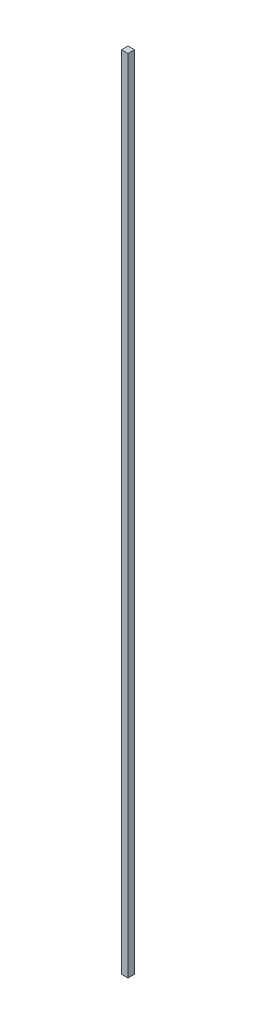
ISO-10303-21;
HEADER;
FILE_DESCRIPTION(('STEP AP214'),'2;1');
FILE_NAME('part.step','',(''),(''),'','','');
FILE_SCHEMA(('AUTOMOTIVE_DESIGN { 1 0 10303 214 1 1 1 1 }'));
ENDSEC;
DATA;
#1=APPLICATION_CONTEXT('core data for automotive mechanical design processes');
#2=APPLICATION_PROTOCOL_DEFINITION('international standard','automotive_design',2000,#1);
#3=PRODUCT_CONTEXT('',#1,'mechanical');
#4=PRODUCT('Part','Part','',(#3));
#5=PRODUCT_RELATED_PRODUCT_CATEGORY('part','',(#4));
#6=PRODUCT_DEFINITION_FORMATION('','',#4);
#7=PRODUCT_DEFINITION_CONTEXT('part definition',#1,'design');
#8=PRODUCT_DEFINITION('design','',#6,#7);
#9=PRODUCT_DEFINITION_SHAPE('','',#8);
#10=(LENGTH_UNIT() NAMED_UNIT(*) SI_UNIT(.MILLI.,.METRE.));
#11=(NAMED_UNIT(*) PLANE_ANGLE_UNIT() SI_UNIT($,.RADIAN.));
#12=(NAMED_UNIT(*) SI_UNIT($,.STERADIAN.) SOLID_ANGLE_UNIT());
#13=UNCERTAINTY_MEASURE_WITH_UNIT(LENGTH_MEASURE(1.E-05),#10,'distance_accuracy_value','');
#14=(GEOMETRIC_REPRESENTATION_CONTEXT(3) GLOBAL_UNCERTAINTY_ASSIGNED_CONTEXT((#13)) GLOBAL_UNIT_ASSIGNED_CONTEXT((#10,
#11,#12)) REPRESENTATION_CONTEXT('',''));
#15=CARTESIAN_POINT('',(0.,0.,0.));
#16=DIRECTION('',(0.,0.,1.));
#17=DIRECTION('',(1.,0.,0.));
#18=AXIS2_PLACEMENT_3D('',#15,#16,#17);
#19=CARTESIAN_POINT('',(0.,2465.,0.));
#20=DIRECTION('',(1.,0.,0.));
#21=DIRECTION('',(0.,0.,-1.));
#22=AXIS2_PLACEMENT_3D('',#19,#20,#21);
#23=PLANE('',#22);
#24=DIRECTION('',(0.,0.,1.));
#25=VECTOR('',#24,1.);
#26=CARTESIAN_POINT('',(0.,0.,0.));
#27=LINE('',#26,#25);
#28=CARTESIAN_POINT('',(0.,0.,0.));
#29=VERTEX_POINT('',#28);
#30=CARTESIAN_POINT('',(0.,0.,20.));
#31=VERTEX_POINT('',#30);
#32=EDGE_CURVE('E95',#29,#31,#27,.T.);
#33=ORIENTED_EDGE('',*,*,#32,.T.);
#34=DIRECTION('',(0.,-1.,0.));
#35=VECTOR('',#34,1.);
#36=CARTESIAN_POINT('',(0.,2465.,20.));
#37=LINE('',#36,#35);
#38=CARTESIAN_POINT('',(0.,2465.,20.));
#39=VERTEX_POINT('',#38);
#40=EDGE_CURVE('E11',#39,#31,#37,.T.);
#41=ORIENTED_EDGE('',*,*,#40,.F.);
#42=DIRECTION('',(0.,0.,1.));
#43=VECTOR('',#42,1.);
#44=CARTESIAN_POINT('',(0.,2465.,0.));
#45=LINE('',#44,#43);
#46=CARTESIAN_POINT('',(0.,2465.,0.));
#47=VERTEX_POINT('',#46);
#48=EDGE_CURVE('E83',#47,#39,#45,.T.);
#49=ORIENTED_EDGE('',*,*,#48,.F.);
#50=DIRECTION('',(0.,-1.,0.));
#51=VECTOR('',#50,1.);
#52=CARTESIAN_POINT('',(0.,2465.,0.));
#53=LINE('',#52,#51);
#54=EDGE_CURVE('E91',#47,#29,#53,.T.);
#55=ORIENTED_EDGE('',*,*,#54,.T.);
#56=EDGE_LOOP('',(#33,#41,#49,#55));
#57=FACE_BOUND('',#56,.T.);
#58=ADVANCED_FACE('F32',(#57),#23,.F.);
#59=CARTESIAN_POINT('',(0.,2465.,20.));
#60=DIRECTION('',(0.,0.,-1.));
#61=DIRECTION('',(-1.,0.,0.));
#62=AXIS2_PLACEMENT_3D('',#59,#60,#61);
#63=PLANE('',#62);
#64=DIRECTION('',(1.,0.,0.));
#65=VECTOR('',#64,1.);
#66=CARTESIAN_POINT('',(0.,0.,20.));
#67=LINE('',#66,#65);
#68=CARTESIAN_POINT('',(20.,0.,20.));
#69=VERTEX_POINT('',#68);
#70=EDGE_CURVE('E87',#31,#69,#67,.T.);
#71=ORIENTED_EDGE('',*,*,#70,.T.);
#72=DIRECTION('',(0.,-1.,0.));
#73=VECTOR('',#72,1.);
#74=CARTESIAN_POINT('',(20.,2465.,20.));
#75=LINE('',#74,#73);
#76=CARTESIAN_POINT('',(20.,2465.,20.));
#77=VERTEX_POINT('',#76);
#78=EDGE_CURVE('E40',#77,#69,#75,.T.);
#79=ORIENTED_EDGE('',*,*,#78,.F.);
#80=DIRECTION('',(1.,0.,0.));
#81=VECTOR('',#80,1.);
#82=CARTESIAN_POINT('',(0.,2465.,20.));
#83=LINE('',#82,#81);
#84=EDGE_CURVE('E78',#39,#77,#83,.T.);
#85=ORIENTED_EDGE('',*,*,#84,.F.);
#86=ORIENTED_EDGE('',*,*,#40,.T.);
#87=EDGE_LOOP('',(#71,#79,#85,#86));
#88=FACE_BOUND('',#87,.T.);
#89=ADVANCED_FACE('F86',(#88),#63,.F.);
#90=CARTESIAN_POINT('',(20.,2465.,0.));
#91=DIRECTION('',(-1.,0.,0.));
#92=DIRECTION('',(0.,0.,1.));
#93=AXIS2_PLACEMENT_3D('',#90,#91,#92);
#94=PLANE('',#93);
#95=DIRECTION('',(0.,0.,-1.));
#96=VECTOR('',#95,1.);
#97=CARTESIAN_POINT('',(20.,0.,0.));
#98=LINE('',#97,#96);
#99=CARTESIAN_POINT('',(20.,0.,0.));
#100=VERTEX_POINT('',#99);
#101=EDGE_CURVE('E65',#69,#100,#98,.T.);
#102=ORIENTED_EDGE('',*,*,#101,.T.);
#103=DIRECTION('',(0.,-1.,0.));
#104=VECTOR('',#103,1.);
#105=CARTESIAN_POINT('',(20.,2465.,0.));
#106=LINE('',#105,#104);
#107=CARTESIAN_POINT('',(20.,2465.,0.));
#108=VERTEX_POINT('',#107);
#109=EDGE_CURVE('E88',#108,#100,#106,.T.);
#110=ORIENTED_EDGE('',*,*,#109,.F.);
#111=DIRECTION('',(0.,0.,-1.));
#112=VECTOR('',#111,1.);
#113=CARTESIAN_POINT('',(20.,2465.,0.));
#114=LINE('',#113,#112);
#115=EDGE_CURVE('E81',#77,#108,#114,.T.);
#116=ORIENTED_EDGE('',*,*,#115,.F.);
#117=ORIENTED_EDGE('',*,*,#78,.T.);
#118=EDGE_LOOP('',(#102,#110,#116,#117));
#119=FACE_BOUND('',#118,.T.);
#120=ADVANCED_FACE('F89',(#119),#94,.F.);
#121=CARTESIAN_POINT('',(0.,2465.,0.));
#122=DIRECTION('',(0.,0.,1.));
#123=DIRECTION('',(1.,0.,0.));
#124=AXIS2_PLACEMENT_3D('',#121,#122,#123);
#125=PLANE('',#124);
#126=DIRECTION('',(-1.,0.,0.));
#127=VECTOR('',#126,1.);
#128=CARTESIAN_POINT('',(0.,0.,0.));
#129=LINE('',#128,#127);
#130=EDGE_CURVE('E71',#100,#29,#129,.T.);
#131=ORIENTED_EDGE('',*,*,#130,.T.);
#132=ORIENTED_EDGE('',*,*,#54,.F.);
#133=DIRECTION('',(-1.,0.,0.));
#134=VECTOR('',#133,1.);
#135=CARTESIAN_POINT('',(0.,2465.,0.));
#136=LINE('',#135,#134);
#137=EDGE_CURVE('E48',#108,#47,#136,.T.);
#138=ORIENTED_EDGE('',*,*,#137,.F.);
#139=ORIENTED_EDGE('',*,*,#109,.T.);
#140=EDGE_LOOP('',(#131,#132,#138,#139));
#141=FACE_BOUND('',#140,.T.);
#142=ADVANCED_FACE('F102',(#141),#125,.F.);
#143=CARTESIAN_POINT('',(0.,2465.,0.));
#144=DIRECTION('',(0.,1.,0.));
#145=DIRECTION('',(0.,0.,1.));
#146=AXIS2_PLACEMENT_3D('',#143,#144,#145);
#147=PLANE('',#146);
#148=ORIENTED_EDGE('',*,*,#48,.T.);
#149=ORIENTED_EDGE('',*,*,#84,.T.);
#150=ORIENTED_EDGE('',*,*,#115,.T.);
#151=ORIENTED_EDGE('',*,*,#137,.T.);
#152=EDGE_LOOP('',(#148,#149,#150,#151));
#153=FACE_BOUND('',#152,.T.);
#154=ADVANCED_FACE('F79',(#153),#147,.T.);
#155=CARTESIAN_POINT('',(0.,0.,0.));
#156=DIRECTION('',(0.,1.,0.));
#157=DIRECTION('',(0.,0.,1.));
#158=AXIS2_PLACEMENT_3D('',#155,#156,#157);
#159=PLANE('',#158);
#160=ORIENTED_EDGE('',*,*,#32,.F.);
#161=ORIENTED_EDGE('',*,*,#130,.F.);
#162=ORIENTED_EDGE('',*,*,#101,.F.);
#163=ORIENTED_EDGE('',*,*,#70,.F.);
#164=EDGE_LOOP('',(#160,#161,#162,#163));
#165=FACE_BOUND('',#164,.T.);
#166=ADVANCED_FACE('F105',(#165),#159,.F.);
#167=CLOSED_SHELL('',(#58,#89,#120,#142,#154,#166));
#168=MANIFOLD_SOLID_BREP('B2',#167);
#169=ADVANCED_BREP_SHAPE_REPRESENTATION('',(#18,#168),#14);
#170=SHAPE_DEFINITION_REPRESENTATION(#9,#169);
ENDSEC;
END-ISO-10303-21;
